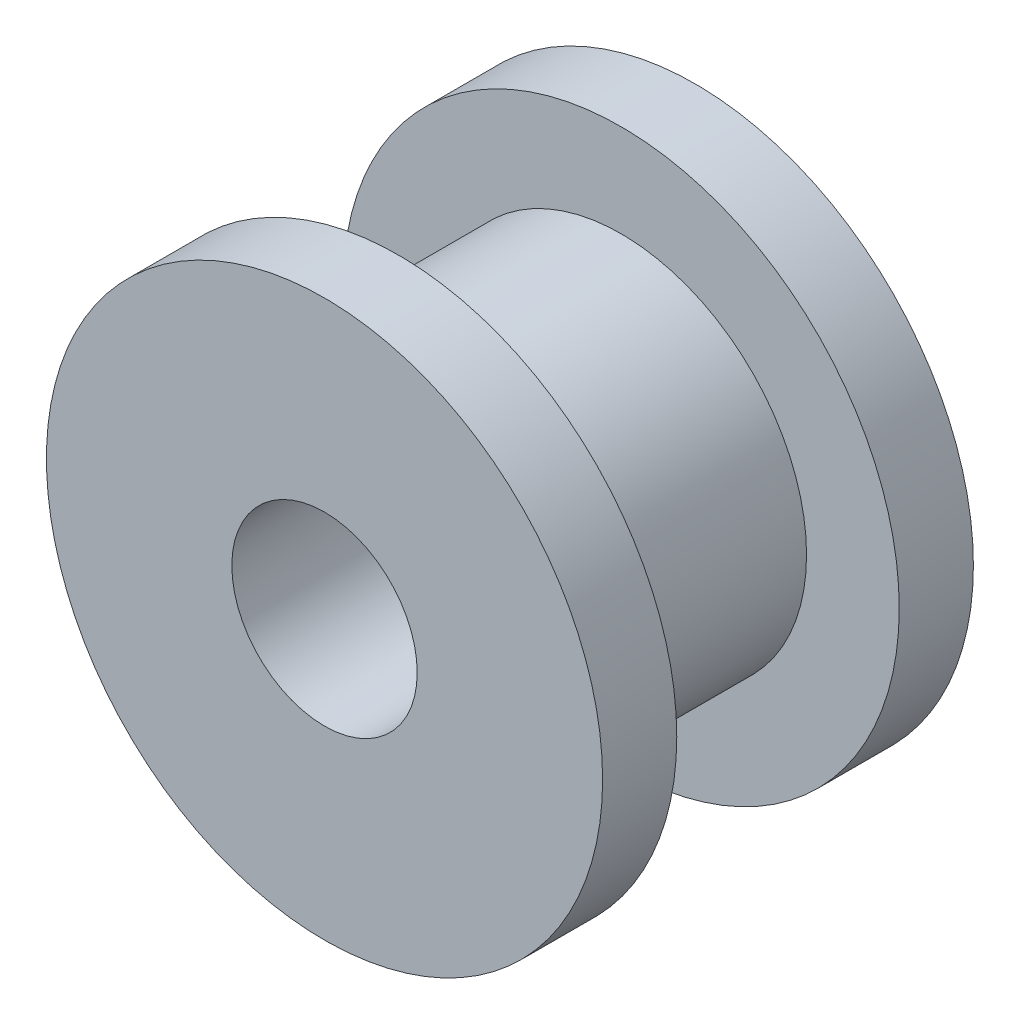
ISO-10303-21;
HEADER;
FILE_DESCRIPTION(('STEP AP214'),'2;1');
FILE_NAME('part.step','',(''),(''),'','','');
FILE_SCHEMA(('AUTOMOTIVE_DESIGN { 1 0 10303 214 1 1 1 1 }'));
ENDSEC;
DATA;
#1=APPLICATION_CONTEXT('core data for automotive mechanical design processes');
#2=APPLICATION_PROTOCOL_DEFINITION('international standard','automotive_design',2000,#1);
#3=PRODUCT_CONTEXT('',#1,'mechanical');
#4=PRODUCT('Part','Part','',(#3));
#5=PRODUCT_RELATED_PRODUCT_CATEGORY('part','',(#4));
#6=PRODUCT_DEFINITION_FORMATION('','',#4);
#7=PRODUCT_DEFINITION_CONTEXT('part definition',#1,'design');
#8=PRODUCT_DEFINITION('design','',#6,#7);
#9=PRODUCT_DEFINITION_SHAPE('','',#8);
#10=(LENGTH_UNIT() NAMED_UNIT(*) SI_UNIT(.MILLI.,.METRE.));
#11=(NAMED_UNIT(*) PLANE_ANGLE_UNIT() SI_UNIT($,.RADIAN.));
#12=(NAMED_UNIT(*) SI_UNIT($,.STERADIAN.) SOLID_ANGLE_UNIT());
#13=UNCERTAINTY_MEASURE_WITH_UNIT(LENGTH_MEASURE(1.E-05),#10,'distance_accuracy_value','');
#14=(GEOMETRIC_REPRESENTATION_CONTEXT(3) GLOBAL_UNCERTAINTY_ASSIGNED_CONTEXT((#13)) GLOBAL_UNIT_ASSIGNED_CONTEXT((#10,
#11,#12)) REPRESENTATION_CONTEXT('',''));
#15=CARTESIAN_POINT('',(0.,0.,0.));
#16=DIRECTION('',(0.,0.,1.));
#17=DIRECTION('',(1.,0.,0.));
#18=AXIS2_PLACEMENT_3D('',#15,#16,#17);
#19=CARTESIAN_POINT('',(0.,0.,2.54));
#20=DIRECTION('',(0.,0.,-1.));
#21=DIRECTION('',(-1.,0.,0.));
#22=AXIS2_PLACEMENT_3D('',#19,#20,#21);
#23=CYLINDRICAL_SURFACE('',#22,9.525);
#24=CARTESIAN_POINT('',(0.,0.,2.54));
#25=DIRECTION('',(0.,0.,1.));
#26=DIRECTION('',(1.,0.,0.));
#27=AXIS2_PLACEMENT_3D('',#24,#25,#26);
#28=CIRCLE('',#27,9.525);
#29=CARTESIAN_POINT('',(9.525,0.,2.54));
#30=VERTEX_POINT('',#29);
#31=EDGE_CURVE('E40',#30,#30,#28,.T.);
#32=ORIENTED_EDGE('',*,*,#31,.F.);
#33=EDGE_LOOP('',(#32));
#34=FACE_BOUND('',#33,.T.);
#35=CARTESIAN_POINT('',(0.,0.,0.));
#36=DIRECTION('',(0.,0.,1.));
#37=DIRECTION('',(1.,0.,0.));
#38=AXIS2_PLACEMENT_3D('',#35,#36,#37);
#39=CIRCLE('',#38,9.525);
#40=CARTESIAN_POINT('',(9.525,0.,0.));
#41=VERTEX_POINT('',#40);
#42=EDGE_CURVE('E36',#41,#41,#39,.T.);
#43=ORIENTED_EDGE('',*,*,#42,.T.);
#44=EDGE_LOOP('',(#43));
#45=FACE_BOUND('',#44,.T.);
#46=ADVANCED_FACE('F33',(#34,#45),#23,.T.);
#47=CARTESIAN_POINT('',(0.,0.,2.54));
#48=DIRECTION('',(0.,0.,1.));
#49=DIRECTION('',(1.,0.,0.));
#50=AXIS2_PLACEMENT_3D('',#47,#48,#49);
#51=PLANE('',#50);
#52=CARTESIAN_POINT('',(0.,0.,2.54));
#53=DIRECTION('',(0.,0.,1.));
#54=DIRECTION('',(1.,0.,0.));
#55=AXIS2_PLACEMENT_3D('',#52,#53,#54);
#56=CIRCLE('',#55,6.35);
#57=CARTESIAN_POINT('',(6.35,0.,2.54));
#58=VERTEX_POINT('',#57);
#59=EDGE_CURVE('E10',#58,#58,#56,.T.);
#60=ORIENTED_EDGE('',*,*,#59,.F.);
#61=EDGE_LOOP('',(#60));
#62=FACE_BOUND('',#61,.T.);
#63=ORIENTED_EDGE('',*,*,#31,.T.);
#64=EDGE_LOOP('',(#63));
#65=FACE_BOUND('',#64,.T.);
#66=ADVANCED_FACE('F87',(#62,#65),#51,.T.);
#67=CARTESIAN_POINT('',(0.,0.,0.));
#68=DIRECTION('',(0.,0.,1.));
#69=DIRECTION('',(1.,0.,0.));
#70=AXIS2_PLACEMENT_3D('',#67,#68,#69);
#71=PLANE('',#70);
#72=CARTESIAN_POINT('',(0.,0.,0.));
#73=DIRECTION('',(0.,0.,1.));
#74=DIRECTION('',(1.,0.,0.));
#75=AXIS2_PLACEMENT_3D('',#72,#73,#74);
#76=CIRCLE('',#75,3.175);
#77=CARTESIAN_POINT('',(3.175,0.,0.));
#78=VERTEX_POINT('',#77);
#79=EDGE_CURVE('E53',#78,#78,#76,.F.);
#80=ORIENTED_EDGE('',*,*,#79,.F.);
#81=EDGE_LOOP('',(#80));
#82=FACE_BOUND('',#81,.T.);
#83=ORIENTED_EDGE('',*,*,#42,.F.);
#84=EDGE_LOOP('',(#83));
#85=FACE_BOUND('',#84,.T.);
#86=ADVANCED_FACE('F83',(#82,#85),#71,.F.);
#87=CARTESIAN_POINT('',(0.,0.,10.16));
#88=DIRECTION('',(0.,0.,-1.));
#89=DIRECTION('',(-1.,0.,0.));
#90=AXIS2_PLACEMENT_3D('',#87,#88,#89);
#91=CYLINDRICAL_SURFACE('',#90,6.35);
#92=CARTESIAN_POINT('',(0.,0.,10.16));
#93=DIRECTION('',(0.,0.,1.));
#94=DIRECTION('',(1.,0.,0.));
#95=AXIS2_PLACEMENT_3D('',#92,#93,#94);
#96=CIRCLE('',#95,6.35);
#97=CARTESIAN_POINT('',(6.35,0.,10.16));
#98=VERTEX_POINT('',#97);
#99=EDGE_CURVE('E46',#98,#98,#96,.T.);
#100=ORIENTED_EDGE('',*,*,#99,.F.);
#101=EDGE_LOOP('',(#100));
#102=FACE_BOUND('',#101,.T.);
#103=ORIENTED_EDGE('',*,*,#59,.T.);
#104=EDGE_LOOP('',(#103));
#105=FACE_BOUND('',#104,.T.);
#106=ADVANCED_FACE('F74',(#102,#105),#91,.T.);
#107=CARTESIAN_POINT('',(0.,0.,10.16));
#108=DIRECTION('',(0.,0.,1.));
#109=DIRECTION('',(1.,0.,0.));
#110=AXIS2_PLACEMENT_3D('',#107,#108,#109);
#111=CYLINDRICAL_SURFACE('',#110,9.525);
#112=CARTESIAN_POINT('',(0.,0.,10.16));
#113=DIRECTION('',(0.,0.,1.));
#114=DIRECTION('',(1.,0.,0.));
#115=AXIS2_PLACEMENT_3D('',#112,#113,#114);
#116=CIRCLE('',#115,9.525);
#117=CARTESIAN_POINT('',(9.525,0.,10.16));
#118=VERTEX_POINT('',#117);
#119=EDGE_CURVE('E49',#118,#118,#116,.T.);
#120=ORIENTED_EDGE('',*,*,#119,.T.);
#121=EDGE_LOOP('',(#120));
#122=FACE_BOUND('',#121,.T.);
#123=CARTESIAN_POINT('',(0.,0.,12.7));
#124=DIRECTION('',(0.,0.,1.));
#125=DIRECTION('',(1.,0.,0.));
#126=AXIS2_PLACEMENT_3D('',#123,#124,#125);
#127=CIRCLE('',#126,9.525);
#128=CARTESIAN_POINT('',(9.525,0.,12.7));
#129=VERTEX_POINT('',#128);
#130=EDGE_CURVE('E50',#129,#129,#127,.T.);
#131=ORIENTED_EDGE('',*,*,#130,.F.);
#132=EDGE_LOOP('',(#131));
#133=FACE_BOUND('',#132,.T.);
#134=ADVANCED_FACE('F72',(#122,#133),#111,.T.);
#135=CARTESIAN_POINT('',(0.,0.,10.16));
#136=DIRECTION('',(0.,0.,-1.));
#137=DIRECTION('',(1.,0.,0.));
#138=AXIS2_PLACEMENT_3D('',#135,#136,#137);
#139=PLANE('',#138);
#140=ORIENTED_EDGE('',*,*,#99,.T.);
#141=EDGE_LOOP('',(#140));
#142=FACE_BOUND('',#141,.T.);
#143=ORIENTED_EDGE('',*,*,#119,.F.);
#144=EDGE_LOOP('',(#143));
#145=FACE_BOUND('',#144,.T.);
#146=ADVANCED_FACE('F68',(#142,#145),#139,.T.);
#147=CARTESIAN_POINT('',(0.,0.,12.7));
#148=DIRECTION('',(0.,0.,-1.));
#149=DIRECTION('',(1.,0.,0.));
#150=AXIS2_PLACEMENT_3D('',#147,#148,#149);
#151=PLANE('',#150);
#152=CARTESIAN_POINT('',(0.,0.,12.7));
#153=DIRECTION('',(0.,0.,1.));
#154=DIRECTION('',(1.,0.,0.));
#155=AXIS2_PLACEMENT_3D('',#152,#153,#154);
#156=CIRCLE('',#155,3.175);
#157=CARTESIAN_POINT('',(3.175,0.,12.7));
#158=VERTEX_POINT('',#157);
#159=EDGE_CURVE('E58',#158,#158,#156,.T.);
#160=ORIENTED_EDGE('',*,*,#159,.F.);
#161=EDGE_LOOP('',(#160));
#162=FACE_BOUND('',#161,.T.);
#163=ORIENTED_EDGE('',*,*,#130,.T.);
#164=EDGE_LOOP('',(#163));
#165=FACE_BOUND('',#164,.T.);
#166=ADVANCED_FACE('F65',(#162,#165),#151,.F.);
#167=CARTESIAN_POINT('',(0.,0.,-0.000999999999999265));
#168=DIRECTION('',(0.,0.,1.));
#169=DIRECTION('',(1.,0.,0.));
#170=AXIS2_PLACEMENT_3D('',#167,#168,#169);
#171=CYLINDRICAL_SURFACE('',#170,3.175);
#172=ORIENTED_EDGE('',*,*,#159,.T.);
#173=EDGE_LOOP('',(#172));
#174=FACE_BOUND('',#173,.T.);
#175=ORIENTED_EDGE('',*,*,#79,.T.);
#176=EDGE_LOOP('',(#175));
#177=FACE_BOUND('',#176,.T.);
#178=ADVANCED_FACE('F62',(#174,#177),#171,.F.);
#179=CLOSED_SHELL('',(#46,#66,#86,#106,#134,#146,#166,#178));
#180=MANIFOLD_SOLID_BREP('B2',#179);
#181=ADVANCED_BREP_SHAPE_REPRESENTATION('',(#18,#180),#14);
#182=SHAPE_DEFINITION_REPRESENTATION(#9,#181);
ENDSEC;
END-ISO-10303-21;
